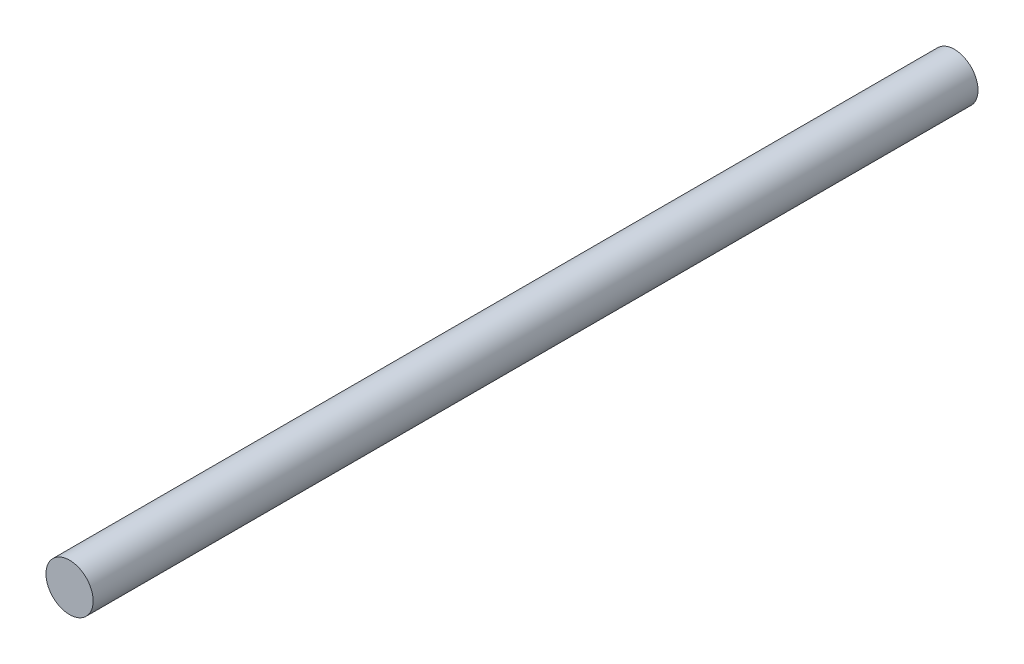
ISO-10303-21;
HEADER;
FILE_DESCRIPTION(('STEP AP214'),'2;1');
FILE_NAME('part.step','',(''),(''),'','','');
FILE_SCHEMA(('AUTOMOTIVE_DESIGN { 1 0 10303 214 1 1 1 1 }'));
ENDSEC;
DATA;
#1=APPLICATION_CONTEXT('core data for automotive mechanical design processes');
#2=APPLICATION_PROTOCOL_DEFINITION('international standard','automotive_design',2000,#1);
#3=PRODUCT_CONTEXT('',#1,'mechanical');
#4=PRODUCT('Part','Part','',(#3));
#5=PRODUCT_RELATED_PRODUCT_CATEGORY('part','',(#4));
#6=PRODUCT_DEFINITION_FORMATION('','',#4);
#7=PRODUCT_DEFINITION_CONTEXT('part definition',#1,'design');
#8=PRODUCT_DEFINITION('design','',#6,#7);
#9=PRODUCT_DEFINITION_SHAPE('','',#8);
#10=(LENGTH_UNIT() NAMED_UNIT(*) SI_UNIT(.MILLI.,.METRE.));
#11=(NAMED_UNIT(*) PLANE_ANGLE_UNIT() SI_UNIT($,.RADIAN.));
#12=(NAMED_UNIT(*) SI_UNIT($,.STERADIAN.) SOLID_ANGLE_UNIT());
#13=UNCERTAINTY_MEASURE_WITH_UNIT(LENGTH_MEASURE(1.E-05),#10,'distance_accuracy_value','');
#14=(GEOMETRIC_REPRESENTATION_CONTEXT(3) GLOBAL_UNCERTAINTY_ASSIGNED_CONTEXT((#13)) GLOBAL_UNIT_ASSIGNED_CONTEXT((#10,
#11,#12)) REPRESENTATION_CONTEXT('',''));
#15=CARTESIAN_POINT('',(0.,0.,0.));
#16=DIRECTION('',(0.,0.,1.));
#17=DIRECTION('',(1.,0.,0.));
#18=AXIS2_PLACEMENT_3D('',#15,#16,#17);
#19=CARTESIAN_POINT('',(0.,0.,150.));
#20=DIRECTION('',(0.,0.,-1.));
#21=DIRECTION('',(-1.,0.,0.));
#22=AXIS2_PLACEMENT_3D('',#19,#20,#21);
#23=CYLINDRICAL_SURFACE('',#22,4.);
#24=CARTESIAN_POINT('',(0.,0.,150.));
#25=DIRECTION('',(0.,0.,1.));
#26=DIRECTION('',(1.,0.,0.));
#27=AXIS2_PLACEMENT_3D('',#24,#25,#26);
#28=CIRCLE('',#27,4.);
#29=CARTESIAN_POINT('',(4.,0.,150.));
#30=VERTEX_POINT('',#29);
#31=EDGE_CURVE('E10',#30,#30,#28,.T.);
#32=ORIENTED_EDGE('',*,*,#31,.F.);
#33=EDGE_LOOP('',(#32));
#34=FACE_BOUND('',#33,.T.);
#35=CARTESIAN_POINT('',(0.,0.,0.));
#36=DIRECTION('',(0.,0.,1.));
#37=DIRECTION('',(1.,0.,0.));
#38=AXIS2_PLACEMENT_3D('',#35,#36,#37);
#39=CIRCLE('',#38,4.);
#40=CARTESIAN_POINT('',(4.,0.,0.));
#41=VERTEX_POINT('',#40);
#42=EDGE_CURVE('E36',#41,#41,#39,.T.);
#43=ORIENTED_EDGE('',*,*,#42,.T.);
#44=EDGE_LOOP('',(#43));
#45=FACE_BOUND('',#44,.T.);
#46=ADVANCED_FACE('F33',(#34,#45),#23,.T.);
#47=CARTESIAN_POINT('',(0.,0.,150.));
#48=DIRECTION('',(0.,0.,1.));
#49=DIRECTION('',(1.,0.,0.));
#50=AXIS2_PLACEMENT_3D('',#47,#48,#49);
#51=PLANE('',#50);
#52=ORIENTED_EDGE('',*,*,#31,.T.);
#53=EDGE_LOOP('',(#52));
#54=FACE_BOUND('',#53,.T.);
#55=ADVANCED_FACE('F48',(#54),#51,.T.);
#56=CARTESIAN_POINT('',(0.,0.,0.));
#57=DIRECTION('',(0.,0.,1.));
#58=DIRECTION('',(1.,0.,0.));
#59=AXIS2_PLACEMENT_3D('',#56,#57,#58);
#60=PLANE('',#59);
#61=ORIENTED_EDGE('',*,*,#42,.F.);
#62=EDGE_LOOP('',(#61));
#63=FACE_BOUND('',#62,.T.);
#64=ADVANCED_FACE('F46',(#63),#60,.F.);
#65=CLOSED_SHELL('',(#46,#55,#64));
#66=MANIFOLD_SOLID_BREP('B2',#65);
#67=ADVANCED_BREP_SHAPE_REPRESENTATION('',(#18,#66),#14);
#68=SHAPE_DEFINITION_REPRESENTATION(#9,#67);
ENDSEC;
END-ISO-10303-21;
